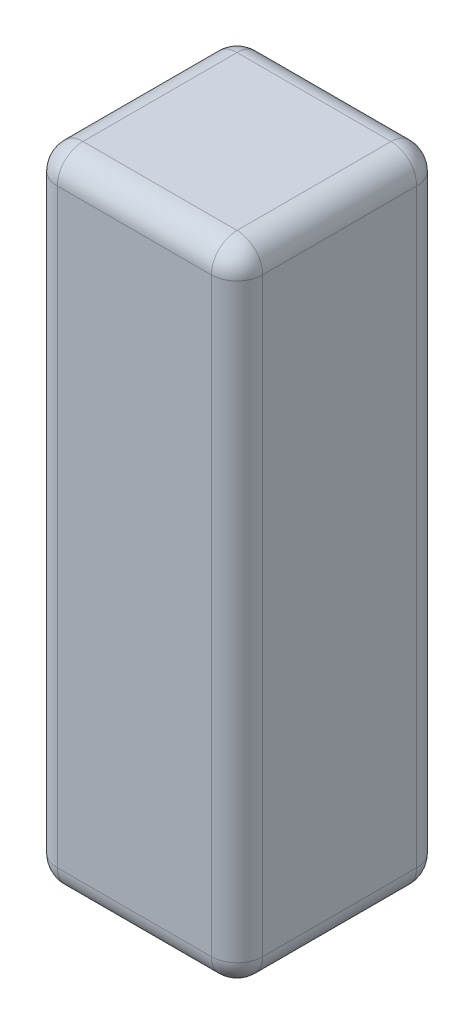
ISO-10303-21;
HEADER;
FILE_DESCRIPTION(('STEP AP214'),'2;1');
FILE_NAME('part.step','',(''),(''),'','','');
FILE_SCHEMA(('AUTOMOTIVE_DESIGN { 1 0 10303 214 1 1 1 1 }'));
ENDSEC;
DATA;
#1=APPLICATION_CONTEXT('core data for automotive mechanical design processes');
#2=APPLICATION_PROTOCOL_DEFINITION('international standard','automotive_design',2000,#1);
#3=PRODUCT_CONTEXT('',#1,'mechanical');
#4=PRODUCT('Part','Part','',(#3));
#5=PRODUCT_RELATED_PRODUCT_CATEGORY('part','',(#4));
#6=PRODUCT_DEFINITION_FORMATION('','',#4);
#7=PRODUCT_DEFINITION_CONTEXT('part definition',#1,'design');
#8=PRODUCT_DEFINITION('design','',#6,#7);
#9=PRODUCT_DEFINITION_SHAPE('','',#8);
#10=(LENGTH_UNIT() NAMED_UNIT(*) SI_UNIT(.MILLI.,.METRE.));
#11=(NAMED_UNIT(*) PLANE_ANGLE_UNIT() SI_UNIT($,.RADIAN.));
#12=(NAMED_UNIT(*) SI_UNIT($,.STERADIAN.) SOLID_ANGLE_UNIT());
#13=UNCERTAINTY_MEASURE_WITH_UNIT(LENGTH_MEASURE(1.E-05),#10,'distance_accuracy_value','');
#14=(GEOMETRIC_REPRESENTATION_CONTEXT(3) GLOBAL_UNCERTAINTY_ASSIGNED_CONTEXT((#13)) GLOBAL_UNIT_ASSIGNED_CONTEXT((#10,
#11,#12)) REPRESENTATION_CONTEXT('',''));
#15=CARTESIAN_POINT('',(0.,0.,0.));
#16=DIRECTION('',(0.,0.,1.));
#17=DIRECTION('',(1.,0.,0.));
#18=AXIS2_PLACEMENT_3D('',#15,#16,#17);
#19=CARTESIAN_POINT('',(52.585871193538,-113.776616403823,-32.));
#20=DIRECTION('',(-1.,0.,0.));
#21=DIRECTION('',(0.,-1.,0.));
#22=AXIS2_PLACEMENT_3D('',#19,#20,#21);
#23=PLANE('',#22);
#24=DIRECTION('',(0.,-1.,0.));
#25=VECTOR('',#24,1.);
#26=CARTESIAN_POINT('',(52.585871193538,-213.776616403823,-28.));
#27=LINE('',#26,#25);
#28=CARTESIAN_POINT('',(52.585871193538,-117.776616403823,-28.));
#29=VERTEX_POINT('',#28);
#30=CARTESIAN_POINT('',(52.585871193538,-209.776616403823,-28.));
#31=VERTEX_POINT('',#30);
#32=EDGE_CURVE('E243',#29,#31,#27,.T.);
#33=ORIENTED_EDGE('',*,*,#32,.T.);
#34=DIRECTION('',(0.,0.,1.));
#35=VECTOR('',#34,1.);
#36=CARTESIAN_POINT('',(52.585871193538,-209.776616403823,-32.));
#37=LINE('',#36,#35);
#38=CARTESIAN_POINT('',(52.585871193538,-209.776616403823,-4.));
#39=VERTEX_POINT('',#38);
#40=EDGE_CURVE('E258',#31,#39,#37,.T.);
#41=ORIENTED_EDGE('',*,*,#40,.T.);
#42=DIRECTION('',(0.,-1.,0.));
#43=VECTOR('',#42,1.);
#44=CARTESIAN_POINT('',(52.585871193538,-113.776616403823,-4.));
#45=LINE('',#44,#43);
#46=CARTESIAN_POINT('',(52.585871193538,-117.776616403823,-4.));
#47=VERTEX_POINT('',#46);
#48=EDGE_CURVE('E251',#39,#47,#45,.F.);
#49=ORIENTED_EDGE('',*,*,#48,.T.);
#50=DIRECTION('',(0.,0.,1.));
#51=VECTOR('',#50,1.);
#52=CARTESIAN_POINT('',(52.585871193538,-117.776616403823,-32.));
#53=LINE('',#52,#51);
#54=EDGE_CURVE('E252',#47,#29,#53,.F.);
#55=ORIENTED_EDGE('',*,*,#54,.T.);
#56=EDGE_LOOP('',(#33,#41,#49,#55));
#57=FACE_BOUND('',#56,.T.);
#58=ADVANCED_FACE('F36',(#57),#23,.T.);
#59=CARTESIAN_POINT('',(52.585871193538,-113.776616403823,-32.));
#60=DIRECTION('',(0.,1.,0.));
#61=DIRECTION('',(0.,0.,1.));
#62=AXIS2_PLACEMENT_3D('',#59,#60,#61);
#63=PLANE('',#62);
#64=DIRECTION('',(-1.,0.,0.));
#65=VECTOR('',#64,1.);
#66=CARTESIAN_POINT('',(52.585871193538,-113.776616403823,-28.));
#67=LINE('',#66,#65);
#68=CARTESIAN_POINT('',(80.585871193538,-113.776616403823,-28.));
#69=VERTEX_POINT('',#68);
#70=CARTESIAN_POINT('',(56.585871193538,-113.776616403823,-28.));
#71=VERTEX_POINT('',#70);
#72=EDGE_CURVE('E226',#69,#71,#67,.T.);
#73=ORIENTED_EDGE('',*,*,#72,.T.);
#74=DIRECTION('',(0.,0.,1.));
#75=VECTOR('',#74,1.);
#76=CARTESIAN_POINT('',(56.585871193538,-113.776616403823,-32.));
#77=LINE('',#76,#75);
#78=CARTESIAN_POINT('',(56.585871193538,-113.776616403823,-4.));
#79=VERTEX_POINT('',#78);
#80=EDGE_CURVE('E11',#71,#79,#77,.T.);
#81=ORIENTED_EDGE('',*,*,#80,.T.);
#82=DIRECTION('',(-1.,0.,0.));
#83=VECTOR('',#82,1.);
#84=CARTESIAN_POINT('',(52.585871193538,-113.776616403823,-4.));
#85=LINE('',#84,#83);
#86=CARTESIAN_POINT('',(80.585871193538,-113.776616403823,-4.));
#87=VERTEX_POINT('',#86);
#88=EDGE_CURVE('E46',#79,#87,#85,.F.);
#89=ORIENTED_EDGE('',*,*,#88,.T.);
#90=DIRECTION('',(0.,0.,1.));
#91=VECTOR('',#90,1.);
#92=CARTESIAN_POINT('',(80.585871193538,-113.776616403823,-32.));
#93=LINE('',#92,#91);
#94=EDGE_CURVE('E222',#87,#69,#93,.F.);
#95=ORIENTED_EDGE('',*,*,#94,.T.);
#96=EDGE_LOOP('',(#73,#81,#89,#95));
#97=FACE_BOUND('',#96,.T.);
#98=ADVANCED_FACE('F224',(#97),#63,.T.);
#99=CARTESIAN_POINT('',(84.585871193538,-113.776616403823,-32.));
#100=DIRECTION('',(1.,0.,0.));
#101=DIRECTION('',(0.,0.,-1.));
#102=AXIS2_PLACEMENT_3D('',#99,#100,#101);
#103=PLANE('',#102);
#104=DIRECTION('',(0.,1.,0.));
#105=VECTOR('',#104,1.);
#106=CARTESIAN_POINT('',(84.585871193538,-113.776616403823,-4.));
#107=LINE('',#106,#105);
#108=CARTESIAN_POINT('',(84.585871193538,-117.776616403823,-4.));
#109=VERTEX_POINT('',#108);
#110=CARTESIAN_POINT('',(84.585871193538,-209.776616403823,-4.));
#111=VERTEX_POINT('',#110);
#112=EDGE_CURVE('E272',#109,#111,#107,.F.);
#113=ORIENTED_EDGE('',*,*,#112,.T.);
#114=DIRECTION('',(0.,0.,1.));
#115=VECTOR('',#114,1.);
#116=CARTESIAN_POINT('',(84.585871193538,-209.776616403823,-32.));
#117=LINE('',#116,#115);
#118=CARTESIAN_POINT('',(84.585871193538,-209.776616403823,-28.));
#119=VERTEX_POINT('',#118);
#120=EDGE_CURVE('E163',#111,#119,#117,.F.);
#121=ORIENTED_EDGE('',*,*,#120,.T.);
#122=DIRECTION('',(0.,1.,0.));
#123=VECTOR('',#122,1.);
#124=CARTESIAN_POINT('',(84.585871193538,-113.776616403823,-28.));
#125=LINE('',#124,#123);
#126=CARTESIAN_POINT('',(84.585871193538,-117.776616403823,-28.));
#127=VERTEX_POINT('',#126);
#128=EDGE_CURVE('E267',#119,#127,#125,.T.);
#129=ORIENTED_EDGE('',*,*,#128,.T.);
#130=DIRECTION('',(0.,0.,1.));
#131=VECTOR('',#130,1.);
#132=CARTESIAN_POINT('',(84.585871193538,-117.776616403823,-32.));
#133=LINE('',#132,#131);
#134=EDGE_CURVE('E269',#127,#109,#133,.T.);
#135=ORIENTED_EDGE('',*,*,#134,.T.);
#136=EDGE_LOOP('',(#113,#121,#129,#135));
#137=FACE_BOUND('',#136,.T.);
#138=ADVANCED_FACE('F367',(#137),#103,.T.);
#139=CARTESIAN_POINT('',(52.585871193538,-213.776616403823,-32.));
#140=DIRECTION('',(0.,-1.,0.));
#141=DIRECTION('',(0.,0.,-1.));
#142=AXIS2_PLACEMENT_3D('',#139,#140,#141);
#143=PLANE('',#142);
#144=DIRECTION('',(0.,0.,1.));
#145=VECTOR('',#144,1.);
#146=CARTESIAN_POINT('',(56.585871193538,-213.776616403823,-32.));
#147=LINE('',#146,#145);
#148=CARTESIAN_POINT('',(56.585871193538,-213.776616403823,-4.));
#149=VERTEX_POINT('',#148);
#150=CARTESIAN_POINT('',(56.585871193538,-213.776616403823,-28.));
#151=VERTEX_POINT('',#150);
#152=EDGE_CURVE('E139',#149,#151,#147,.F.);
#153=ORIENTED_EDGE('',*,*,#152,.T.);
#154=DIRECTION('',(1.,0.,0.));
#155=VECTOR('',#154,1.);
#156=CARTESIAN_POINT('',(84.585871193538,-213.776616403823,-28.));
#157=LINE('',#156,#155);
#158=CARTESIAN_POINT('',(80.585871193538,-213.776616403823,-28.));
#159=VERTEX_POINT('',#158);
#160=EDGE_CURVE('E135',#151,#159,#157,.T.);
#161=ORIENTED_EDGE('',*,*,#160,.T.);
#162=DIRECTION('',(0.,0.,1.));
#163=VECTOR('',#162,1.);
#164=CARTESIAN_POINT('',(80.585871193538,-213.776616403823,-32.));
#165=LINE('',#164,#163);
#166=CARTESIAN_POINT('',(80.585871193538,-213.776616403823,-4.));
#167=VERTEX_POINT('',#166);
#168=EDGE_CURVE('E129',#159,#167,#165,.T.);
#169=ORIENTED_EDGE('',*,*,#168,.T.);
#170=DIRECTION('',(1.,0.,0.));
#171=VECTOR('',#170,1.);
#172=CARTESIAN_POINT('',(52.585871193538,-213.776616403823,-4.));
#173=LINE('',#172,#171);
#174=EDGE_CURVE('E132',#167,#149,#173,.F.);
#175=ORIENTED_EDGE('',*,*,#174,.T.);
#176=EDGE_LOOP('',(#153,#161,#169,#175));
#177=FACE_BOUND('',#176,.T.);
#178=ADVANCED_FACE('F131',(#177),#143,.T.);
#179=CARTESIAN_POINT('',(0.,0.,-32.));
#180=DIRECTION('',(0.,0.,1.));
#181=DIRECTION('',(1.,0.,0.));
#182=AXIS2_PLACEMENT_3D('',#179,#180,#181);
#183=PLANE('',#182);
#184=DIRECTION('',(0.,1.,0.));
#185=VECTOR('',#184,1.);
#186=CARTESIAN_POINT('',(80.585871193538,-213.776616403823,-32.));
#187=LINE('',#186,#185);
#188=CARTESIAN_POINT('',(80.585871193538,-117.776616403823,-32.));
#189=VERTEX_POINT('',#188);
#190=CARTESIAN_POINT('',(80.585871193538,-209.776616403823,-32.));
#191=VERTEX_POINT('',#190);
#192=EDGE_CURVE('E318',#189,#191,#187,.F.);
#193=ORIENTED_EDGE('',*,*,#192,.T.);
#194=DIRECTION('',(1.,0.,0.));
#195=VECTOR('',#194,1.);
#196=CARTESIAN_POINT('',(52.585871193538,-209.776616403823,-32.));
#197=LINE('',#196,#195);
#198=CARTESIAN_POINT('',(56.585871193538,-209.776616403823,-32.));
#199=VERTEX_POINT('',#198);
#200=EDGE_CURVE('E261',#191,#199,#197,.F.);
#201=ORIENTED_EDGE('',*,*,#200,.T.);
#202=DIRECTION('',(0.,-1.,0.));
#203=VECTOR('',#202,1.);
#204=CARTESIAN_POINT('',(56.585871193538,-113.776616403823,-32.));
#205=LINE('',#204,#203);
#206=CARTESIAN_POINT('',(56.585871193538,-117.776616403823,-32.));
#207=VERTEX_POINT('',#206);
#208=EDGE_CURVE('E310',#199,#207,#205,.F.);
#209=ORIENTED_EDGE('',*,*,#208,.T.);
#210=DIRECTION('',(-1.,0.,0.));
#211=VECTOR('',#210,1.);
#212=CARTESIAN_POINT('',(84.585871193538,-117.776616403823,-32.));
#213=LINE('',#212,#211);
#214=EDGE_CURVE('E236',#207,#189,#213,.F.);
#215=ORIENTED_EDGE('',*,*,#214,.T.);
#216=EDGE_LOOP('',(#193,#201,#209,#215));
#217=FACE_BOUND('',#216,.T.);
#218=ADVANCED_FACE('F316',(#217),#183,.F.);
#219=CARTESIAN_POINT('',(0.,0.,0.));
#220=DIRECTION('',(0.,0.,1.));
#221=DIRECTION('',(1.,0.,0.));
#222=AXIS2_PLACEMENT_3D('',#219,#220,#221);
#223=PLANE('',#222);
#224=DIRECTION('',(0.,-1.,0.));
#225=VECTOR('',#224,1.);
#226=CARTESIAN_POINT('',(56.585871193538,0.,0.));
#227=LINE('',#226,#225);
#228=CARTESIAN_POINT('',(56.585871193538,-117.776616403823,0.));
#229=VERTEX_POINT('',#228);
#230=CARTESIAN_POINT('',(56.585871193538,-209.776616403823,0.));
#231=VERTEX_POINT('',#230);
#232=EDGE_CURVE('E282',#229,#231,#227,.T.);
#233=ORIENTED_EDGE('',*,*,#232,.T.);
#234=DIRECTION('',(1.,0.,0.));
#235=VECTOR('',#234,1.);
#236=CARTESIAN_POINT('',(0.,-209.776616403823,0.));
#237=LINE('',#236,#235);
#238=CARTESIAN_POINT('',(80.585871193538,-209.776616403823,0.));
#239=VERTEX_POINT('',#238);
#240=EDGE_CURVE('E285',#231,#239,#237,.T.);
#241=ORIENTED_EDGE('',*,*,#240,.T.);
#242=DIRECTION('',(0.,1.,0.));
#243=VECTOR('',#242,1.);
#244=CARTESIAN_POINT('',(80.585871193538,0.,0.));
#245=LINE('',#244,#243);
#246=CARTESIAN_POINT('',(80.585871193538,-117.776616403823,0.));
#247=VERTEX_POINT('',#246);
#248=EDGE_CURVE('E280',#239,#247,#245,.T.);
#249=ORIENTED_EDGE('',*,*,#248,.T.);
#250=DIRECTION('',(-1.,0.,0.));
#251=VECTOR('',#250,1.);
#252=CARTESIAN_POINT('',(0.,-117.776616403823,0.));
#253=LINE('',#252,#251);
#254=EDGE_CURVE('E277',#247,#229,#253,.T.);
#255=ORIENTED_EDGE('',*,*,#254,.T.);
#256=EDGE_LOOP('',(#233,#241,#249,#255));
#257=FACE_BOUND('',#256,.T.);
#258=ADVANCED_FACE('F338',(#257),#223,.T.);
#259=CARTESIAN_POINT('',(0.,-117.776616403823,-4.));
#260=DIRECTION('',(-1.,0.,0.));
#261=DIRECTION('',(0.,0.,1.));
#262=AXIS2_PLACEMENT_3D('',#259,#260,#261);
#263=CYLINDRICAL_SURFACE('',#262,4.);
#264=CARTESIAN_POINT('',(56.585871193538,-117.776616403823,-4.));
#265=DIRECTION('',(-1.,0.,0.));
#266=DIRECTION('',(0.,0.,1.));
#267=AXIS2_PLACEMENT_3D('',#264,#265,#266);
#268=CIRCLE('',#267,4.);
#269=EDGE_CURVE('E40',#229,#79,#268,.T.);
#270=ORIENTED_EDGE('',*,*,#269,.F.);
#271=ORIENTED_EDGE('',*,*,#254,.F.);
#272=CARTESIAN_POINT('',(80.585871193538,-117.776616403823,-4.));
#273=DIRECTION('',(1.,0.,0.));
#274=DIRECTION('',(0.,0.,-1.));
#275=AXIS2_PLACEMENT_3D('',#272,#273,#274);
#276=CIRCLE('',#275,4.);
#277=EDGE_CURVE('E205',#87,#247,#276,.T.);
#278=ORIENTED_EDGE('',*,*,#277,.F.);
#279=ORIENTED_EDGE('',*,*,#88,.F.);
#280=EDGE_LOOP('',(#270,#271,#278,#279));
#281=FACE_BOUND('',#280,.T.);
#282=ADVANCED_FACE('F38',(#281),#263,.T.);
#283=CARTESIAN_POINT('',(56.585871193538,-117.776616403823,-4.));
#284=DIRECTION('',(0.,0.,1.));
#285=DIRECTION('',(1.,0.,0.));
#286=AXIS2_PLACEMENT_3D('',#283,#284,#285);
#287=SPHERICAL_SURFACE('',#286,4.);
#288=CARTESIAN_POINT('',(56.585871193538,-117.776616403823,-4.));
#289=DIRECTION('',(0.,1.,0.));
#290=DIRECTION('',(0.,0.,1.));
#291=AXIS2_PLACEMENT_3D('',#288,#289,#290);
#292=CIRCLE('',#291,4.);
#293=EDGE_CURVE('E202',#229,#47,#292,.F.);
#294=ORIENTED_EDGE('',*,*,#293,.F.);
#295=ORIENTED_EDGE('',*,*,#269,.T.);
#296=CARTESIAN_POINT('',(56.585871193538,-117.776616403823,-4.));
#297=DIRECTION('',(0.,0.,1.));
#298=DIRECTION('',(1.,0.,0.));
#299=AXIS2_PLACEMENT_3D('',#296,#297,#298);
#300=CIRCLE('',#299,4.);
#301=EDGE_CURVE('E54',#47,#79,#300,.F.);
#302=ORIENTED_EDGE('',*,*,#301,.F.);
#303=EDGE_LOOP('',(#294,#295,#302));
#304=FACE_BOUND('',#303,.T.);
#305=ADVANCED_FACE('F217',(#304),#287,.T.);
#306=CARTESIAN_POINT('',(80.585871193538,-117.776616403823,-4.));
#307=DIRECTION('',(0.,0.,1.));
#308=DIRECTION('',(1.,0.,0.));
#309=AXIS2_PLACEMENT_3D('',#306,#307,#308);
#310=SPHERICAL_SURFACE('',#309,4.);
#311=CARTESIAN_POINT('',(80.585871193538,-117.776616403823,-4.));
#312=DIRECTION('',(0.,0.,1.));
#313=DIRECTION('',(1.,0.,0.));
#314=AXIS2_PLACEMENT_3D('',#311,#312,#313);
#315=CIRCLE('',#314,4.);
#316=EDGE_CURVE('E196',#87,#109,#315,.F.);
#317=ORIENTED_EDGE('',*,*,#316,.F.);
#318=ORIENTED_EDGE('',*,*,#277,.T.);
#319=CARTESIAN_POINT('',(80.585871193538,-117.776616403823,-4.));
#320=DIRECTION('',(0.,1.,0.));
#321=DIRECTION('',(0.,0.,1.));
#322=AXIS2_PLACEMENT_3D('',#319,#320,#321);
#323=CIRCLE('',#322,4.);
#324=EDGE_CURVE('E199',#109,#247,#323,.F.);
#325=ORIENTED_EDGE('',*,*,#324,.F.);
#326=EDGE_LOOP('',(#317,#318,#325));
#327=FACE_BOUND('',#326,.T.);
#328=ADVANCED_FACE('F342',(#327),#310,.T.);
#329=CARTESIAN_POINT('',(56.585871193538,-117.776616403823,-32.));
#330=DIRECTION('',(0.,0.,1.));
#331=DIRECTION('',(1.,0.,0.));
#332=AXIS2_PLACEMENT_3D('',#329,#330,#331);
#333=CYLINDRICAL_SURFACE('',#332,4.);
#334=ORIENTED_EDGE('',*,*,#301,.T.);
#335=ORIENTED_EDGE('',*,*,#80,.F.);
#336=CARTESIAN_POINT('',(56.585871193538,-117.776616403823,-28.));
#337=DIRECTION('',(0.,0.,-1.));
#338=DIRECTION('',(-1.,0.,0.));
#339=AXIS2_PLACEMENT_3D('',#336,#337,#338);
#340=CIRCLE('',#339,4.);
#341=EDGE_CURVE('E190',#29,#71,#340,.T.);
#342=ORIENTED_EDGE('',*,*,#341,.F.);
#343=ORIENTED_EDGE('',*,*,#54,.F.);
#344=EDGE_LOOP('',(#334,#335,#342,#343));
#345=FACE_BOUND('',#344,.T.);
#346=ADVANCED_FACE('F229',(#345),#333,.T.);
#347=CARTESIAN_POINT('',(56.585871193538,0.,-4.));
#348=DIRECTION('',(0.,-1.,0.));
#349=DIRECTION('',(1.,0.,0.));
#350=AXIS2_PLACEMENT_3D('',#347,#348,#349);
#351=CYLINDRICAL_SURFACE('',#350,4.);
#352=ORIENTED_EDGE('',*,*,#293,.T.);
#353=ORIENTED_EDGE('',*,*,#48,.F.);
#354=CARTESIAN_POINT('',(56.585871193538,-209.776616403823,-4.));
#355=DIRECTION('',(0.,-1.,0.));
#356=DIRECTION('',(0.,0.,-1.));
#357=AXIS2_PLACEMENT_3D('',#354,#355,#356);
#358=CIRCLE('',#357,4.);
#359=EDGE_CURVE('E186',#231,#39,#358,.T.);
#360=ORIENTED_EDGE('',*,*,#359,.F.);
#361=ORIENTED_EDGE('',*,*,#232,.F.);
#362=EDGE_LOOP('',(#352,#353,#360,#361));
#363=FACE_BOUND('',#362,.T.);
#364=ADVANCED_FACE('F336',(#363),#351,.T.);
#365=CARTESIAN_POINT('',(0.,-209.776616403823,-4.));
#366=DIRECTION('',(1.,0.,0.));
#367=DIRECTION('',(0.,0.,-1.));
#368=AXIS2_PLACEMENT_3D('',#365,#366,#367);
#369=CYLINDRICAL_SURFACE('',#368,4.);
#370=CARTESIAN_POINT('',(80.585871193538,-209.776616403823,-4.));
#371=DIRECTION('',(1.,0.,0.));
#372=DIRECTION('',(0.,0.,-1.));
#373=AXIS2_PLACEMENT_3D('',#370,#371,#372);
#374=CIRCLE('',#373,4.);
#375=EDGE_CURVE('E146',#239,#167,#374,.T.);
#376=ORIENTED_EDGE('',*,*,#375,.F.);
#377=ORIENTED_EDGE('',*,*,#240,.F.);
#378=CARTESIAN_POINT('',(56.585871193538,-209.776616403823,-4.));
#379=DIRECTION('',(-1.,0.,0.));
#380=DIRECTION('',(0.,0.,1.));
#381=AXIS2_PLACEMENT_3D('',#378,#379,#380);
#382=CIRCLE('',#381,4.);
#383=EDGE_CURVE('E149',#149,#231,#382,.T.);
#384=ORIENTED_EDGE('',*,*,#383,.F.);
#385=ORIENTED_EDGE('',*,*,#174,.F.);
#386=EDGE_LOOP('',(#376,#377,#384,#385));
#387=FACE_BOUND('',#386,.T.);
#388=ADVANCED_FACE('F144',(#387),#369,.T.);
#389=CARTESIAN_POINT('',(80.585871193538,0.,-4.));
#390=DIRECTION('',(0.,1.,0.));
#391=DIRECTION('',(0.,0.,1.));
#392=AXIS2_PLACEMENT_3D('',#389,#390,#391);
#393=CYLINDRICAL_SURFACE('',#392,4.);
#394=ORIENTED_EDGE('',*,*,#324,.T.);
#395=ORIENTED_EDGE('',*,*,#248,.F.);
#396=CARTESIAN_POINT('',(80.585871193538,-209.776616403823,-4.));
#397=DIRECTION('',(0.,-1.,0.));
#398=DIRECTION('',(0.,0.,-1.));
#399=AXIS2_PLACEMENT_3D('',#396,#397,#398);
#400=CIRCLE('',#399,4.);
#401=EDGE_CURVE('E159',#111,#239,#400,.T.);
#402=ORIENTED_EDGE('',*,*,#401,.F.);
#403=ORIENTED_EDGE('',*,*,#112,.F.);
#404=EDGE_LOOP('',(#394,#395,#402,#403));
#405=FACE_BOUND('',#404,.T.);
#406=ADVANCED_FACE('F340',(#405),#393,.T.);
#407=CARTESIAN_POINT('',(80.585871193538,-117.776616403823,-32.));
#408=DIRECTION('',(0.,0.,1.));
#409=DIRECTION('',(1.,0.,0.));
#410=AXIS2_PLACEMENT_3D('',#407,#408,#409);
#411=CYLINDRICAL_SURFACE('',#410,4.);
#412=ORIENTED_EDGE('',*,*,#316,.T.);
#413=ORIENTED_EDGE('',*,*,#134,.F.);
#414=CARTESIAN_POINT('',(80.585871193538,-117.776616403823,-28.));
#415=DIRECTION('',(0.,0.,-1.));
#416=DIRECTION('',(-1.,0.,0.));
#417=AXIS2_PLACEMENT_3D('',#414,#415,#416);
#418=CIRCLE('',#417,4.);
#419=EDGE_CURVE('E181',#69,#127,#418,.T.);
#420=ORIENTED_EDGE('',*,*,#419,.F.);
#421=ORIENTED_EDGE('',*,*,#94,.F.);
#422=EDGE_LOOP('',(#412,#413,#420,#421));
#423=FACE_BOUND('',#422,.T.);
#424=ADVANCED_FACE('F346',(#423),#411,.T.);
#425=CARTESIAN_POINT('',(52.585871193538,-117.776616403823,-28.));
#426=DIRECTION('',(1.,0.,0.));
#427=DIRECTION('',(0.,0.,-1.));
#428=AXIS2_PLACEMENT_3D('',#425,#426,#427);
#429=CYLINDRICAL_SURFACE('',#428,4.);
#430=CARTESIAN_POINT('',(56.585871193538,-117.776616403823,-28.));
#431=DIRECTION('',(-1.,0.,0.));
#432=DIRECTION('',(0.,0.,1.));
#433=AXIS2_PLACEMENT_3D('',#430,#431,#432);
#434=CIRCLE('',#433,4.);
#435=EDGE_CURVE('E193',#71,#207,#434,.T.);
#436=ORIENTED_EDGE('',*,*,#435,.F.);
#437=ORIENTED_EDGE('',*,*,#72,.F.);
#438=CARTESIAN_POINT('',(80.585871193538,-117.776616403823,-28.));
#439=DIRECTION('',(1.,0.,0.));
#440=DIRECTION('',(0.,0.,-1.));
#441=AXIS2_PLACEMENT_3D('',#438,#439,#440);
#442=CIRCLE('',#441,4.);
#443=EDGE_CURVE('E177',#189,#69,#442,.T.);
#444=ORIENTED_EDGE('',*,*,#443,.F.);
#445=ORIENTED_EDGE('',*,*,#214,.F.);
#446=EDGE_LOOP('',(#436,#437,#444,#445));
#447=FACE_BOUND('',#446,.T.);
#448=ADVANCED_FACE('F233',(#447),#429,.T.);
#449=CARTESIAN_POINT('',(56.585871193538,-117.776616403823,-28.));
#450=DIRECTION('',(0.,0.,1.));
#451=DIRECTION('',(1.,0.,0.));
#452=AXIS2_PLACEMENT_3D('',#449,#450,#451);
#453=SPHERICAL_SURFACE('',#452,4.);
#454=ORIENTED_EDGE('',*,*,#341,.T.);
#455=ORIENTED_EDGE('',*,*,#435,.T.);
#456=CARTESIAN_POINT('',(56.585871193538,-117.776616403823,-28.));
#457=DIRECTION('',(0.,1.,0.));
#458=DIRECTION('',(0.,0.,1.));
#459=AXIS2_PLACEMENT_3D('',#456,#457,#458);
#460=CIRCLE('',#459,4.);
#461=EDGE_CURVE('E168',#29,#207,#460,.F.);
#462=ORIENTED_EDGE('',*,*,#461,.F.);
#463=EDGE_LOOP('',(#454,#455,#462));
#464=FACE_BOUND('',#463,.T.);
#465=ADVANCED_FACE('F238',(#464),#453,.T.);
#466=CARTESIAN_POINT('',(56.585871193538,-209.776616403823,-4.));
#467=DIRECTION('',(0.,0.,1.));
#468=DIRECTION('',(1.,0.,0.));
#469=AXIS2_PLACEMENT_3D('',#466,#467,#468);
#470=SPHERICAL_SURFACE('',#469,4.);
#471=ORIENTED_EDGE('',*,*,#383,.T.);
#472=ORIENTED_EDGE('',*,*,#359,.T.);
#473=CARTESIAN_POINT('',(56.585871193538,-209.776616403823,-4.));
#474=DIRECTION('',(0.,0.,1.));
#475=DIRECTION('',(1.,0.,0.));
#476=AXIS2_PLACEMENT_3D('',#473,#474,#475);
#477=CIRCLE('',#476,4.);
#478=EDGE_CURVE('E164',#149,#39,#477,.F.);
#479=ORIENTED_EDGE('',*,*,#478,.F.);
#480=EDGE_LOOP('',(#471,#472,#479));
#481=FACE_BOUND('',#480,.T.);
#482=ADVANCED_FACE('F448',(#481),#470,.T.);
#483=CARTESIAN_POINT('',(80.585871193538,-209.776616403823,-4.));
#484=DIRECTION('',(0.,0.,1.));
#485=DIRECTION('',(1.,0.,0.));
#486=AXIS2_PLACEMENT_3D('',#483,#484,#485);
#487=SPHERICAL_SURFACE('',#486,4.);
#488=ORIENTED_EDGE('',*,*,#401,.T.);
#489=ORIENTED_EDGE('',*,*,#375,.T.);
#490=CARTESIAN_POINT('',(80.585871193538,-209.776616403823,-4.));
#491=DIRECTION('',(0.,0.,1.));
#492=DIRECTION('',(1.,0.,0.));
#493=AXIS2_PLACEMENT_3D('',#490,#491,#492);
#494=CIRCLE('',#493,4.);
#495=EDGE_CURVE('E156',#111,#167,#494,.F.);
#496=ORIENTED_EDGE('',*,*,#495,.F.);
#497=EDGE_LOOP('',(#488,#489,#496));
#498=FACE_BOUND('',#497,.T.);
#499=ADVANCED_FACE('F155',(#498),#487,.T.);
#500=CARTESIAN_POINT('',(80.585871193538,-117.776616403823,-28.));
#501=DIRECTION('',(0.,0.,1.));
#502=DIRECTION('',(1.,0.,0.));
#503=AXIS2_PLACEMENT_3D('',#500,#501,#502);
#504=SPHERICAL_SURFACE('',#503,4.);
#505=ORIENTED_EDGE('',*,*,#443,.T.);
#506=ORIENTED_EDGE('',*,*,#419,.T.);
#507=CARTESIAN_POINT('',(80.585871193538,-117.776616403823,-28.));
#508=DIRECTION('',(0.,1.,0.));
#509=DIRECTION('',(0.,0.,1.));
#510=AXIS2_PLACEMENT_3D('',#507,#508,#509);
#511=CIRCLE('',#510,4.);
#512=EDGE_CURVE('E165',#189,#127,#511,.F.);
#513=ORIENTED_EDGE('',*,*,#512,.F.);
#514=EDGE_LOOP('',(#505,#506,#513));
#515=FACE_BOUND('',#514,.T.);
#516=ADVANCED_FACE('F349',(#515),#504,.T.);
#517=CARTESIAN_POINT('',(56.585871193538,-113.776616403823,-28.));
#518=DIRECTION('',(0.,1.,0.));
#519=DIRECTION('',(-1.,0.,0.));
#520=AXIS2_PLACEMENT_3D('',#517,#518,#519);
#521=CYLINDRICAL_SURFACE('',#520,4.);
#522=ORIENTED_EDGE('',*,*,#461,.T.);
#523=ORIENTED_EDGE('',*,*,#208,.F.);
#524=CARTESIAN_POINT('',(56.585871193538,-209.776616403823,-28.));
#525=DIRECTION('',(0.,-1.,0.));
#526=DIRECTION('',(0.,0.,-1.));
#527=AXIS2_PLACEMENT_3D('',#524,#525,#526);
#528=CIRCLE('',#527,4.);
#529=EDGE_CURVE('E171',#31,#199,#528,.T.);
#530=ORIENTED_EDGE('',*,*,#529,.F.);
#531=ORIENTED_EDGE('',*,*,#32,.F.);
#532=EDGE_LOOP('',(#522,#523,#530,#531));
#533=FACE_BOUND('',#532,.T.);
#534=ADVANCED_FACE('F244',(#533),#521,.T.);
#535=CARTESIAN_POINT('',(56.585871193538,-209.776616403823,-32.));
#536=DIRECTION('',(0.,0.,1.));
#537=DIRECTION('',(1.,0.,0.));
#538=AXIS2_PLACEMENT_3D('',#535,#536,#537);
#539=CYLINDRICAL_SURFACE('',#538,4.);
#540=ORIENTED_EDGE('',*,*,#478,.T.);
#541=ORIENTED_EDGE('',*,*,#40,.F.);
#542=CARTESIAN_POINT('',(56.585871193538,-209.776616403823,-28.));
#543=DIRECTION('',(0.,0.,-1.));
#544=DIRECTION('',(-1.,0.,0.));
#545=AXIS2_PLACEMENT_3D('',#542,#543,#544);
#546=CIRCLE('',#545,4.);
#547=EDGE_CURVE('E302',#151,#31,#546,.T.);
#548=ORIENTED_EDGE('',*,*,#547,.F.);
#549=ORIENTED_EDGE('',*,*,#152,.F.);
#550=EDGE_LOOP('',(#540,#541,#548,#549));
#551=FACE_BOUND('',#550,.T.);
#552=ADVANCED_FACE('F332',(#551),#539,.T.);
#553=CARTESIAN_POINT('',(80.585871193538,-209.776616403823,-32.));
#554=DIRECTION('',(0.,0.,1.));
#555=DIRECTION('',(1.,0.,0.));
#556=AXIS2_PLACEMENT_3D('',#553,#554,#555);
#557=CYLINDRICAL_SURFACE('',#556,4.);
#558=ORIENTED_EDGE('',*,*,#495,.T.);
#559=ORIENTED_EDGE('',*,*,#168,.F.);
#560=CARTESIAN_POINT('',(80.585871193538,-209.776616403823,-28.));
#561=DIRECTION('',(0.,0.,-1.));
#562=DIRECTION('',(-1.,0.,0.));
#563=AXIS2_PLACEMENT_3D('',#560,#561,#562);
#564=CIRCLE('',#563,4.);
#565=EDGE_CURVE('E298',#119,#159,#564,.T.);
#566=ORIENTED_EDGE('',*,*,#565,.F.);
#567=ORIENTED_EDGE('',*,*,#120,.F.);
#568=EDGE_LOOP('',(#558,#559,#566,#567));
#569=FACE_BOUND('',#568,.T.);
#570=ADVANCED_FACE('F161',(#569),#557,.T.);
#571=CARTESIAN_POINT('',(80.585871193538,-113.776616403823,-28.));
#572=DIRECTION('',(0.,-1.,0.));
#573=DIRECTION('',(0.,0.,-1.));
#574=AXIS2_PLACEMENT_3D('',#571,#572,#573);
#575=CYLINDRICAL_SURFACE('',#574,4.);
#576=ORIENTED_EDGE('',*,*,#512,.T.);
#577=ORIENTED_EDGE('',*,*,#128,.F.);
#578=CARTESIAN_POINT('',(80.585871193538,-209.776616403823,-28.));
#579=DIRECTION('',(0.,-1.,0.));
#580=DIRECTION('',(0.,0.,-1.));
#581=AXIS2_PLACEMENT_3D('',#578,#579,#580);
#582=CIRCLE('',#581,4.);
#583=EDGE_CURVE('E296',#191,#119,#582,.T.);
#584=ORIENTED_EDGE('',*,*,#583,.F.);
#585=ORIENTED_EDGE('',*,*,#192,.F.);
#586=EDGE_LOOP('',(#576,#577,#584,#585));
#587=FACE_BOUND('',#586,.T.);
#588=ADVANCED_FACE('F352',(#587),#575,.T.);
#589=CARTESIAN_POINT('',(56.585871193538,-209.776616403823,-28.));
#590=DIRECTION('',(0.,0.,1.));
#591=DIRECTION('',(1.,0.,0.));
#592=AXIS2_PLACEMENT_3D('',#589,#590,#591);
#593=SPHERICAL_SURFACE('',#592,4.);
#594=ORIENTED_EDGE('',*,*,#547,.T.);
#595=ORIENTED_EDGE('',*,*,#529,.T.);
#596=CARTESIAN_POINT('',(56.585871193538,-209.776616403823,-28.));
#597=DIRECTION('',(-1.,0.,0.));
#598=DIRECTION('',(0.,0.,1.));
#599=AXIS2_PLACEMENT_3D('',#596,#597,#598);
#600=CIRCLE('',#599,4.);
#601=EDGE_CURVE('E294',#151,#199,#600,.F.);
#602=ORIENTED_EDGE('',*,*,#601,.F.);
#603=EDGE_LOOP('',(#594,#595,#602));
#604=FACE_BOUND('',#603,.T.);
#605=ADVANCED_FACE('F308',(#604),#593,.T.);
#606=CARTESIAN_POINT('',(80.585871193538,-209.776616403823,-28.));
#607=DIRECTION('',(0.,0.,1.));
#608=DIRECTION('',(1.,0.,0.));
#609=AXIS2_PLACEMENT_3D('',#606,#607,#608);
#610=SPHERICAL_SURFACE('',#609,4.);
#611=ORIENTED_EDGE('',*,*,#583,.T.);
#612=ORIENTED_EDGE('',*,*,#565,.T.);
#613=CARTESIAN_POINT('',(80.585871193538,-209.776616403823,-28.));
#614=DIRECTION('',(1.,0.,0.));
#615=DIRECTION('',(0.,0.,-1.));
#616=AXIS2_PLACEMENT_3D('',#613,#614,#615);
#617=CIRCLE('',#616,4.);
#618=EDGE_CURVE('E292',#191,#159,#617,.F.);
#619=ORIENTED_EDGE('',*,*,#618,.F.);
#620=EDGE_LOOP('',(#611,#612,#619));
#621=FACE_BOUND('',#620,.T.);
#622=ADVANCED_FACE('F354',(#621),#610,.T.);
#623=CARTESIAN_POINT('',(52.585871193538,-209.776616403823,-28.));
#624=DIRECTION('',(-1.,0.,0.));
#625=DIRECTION('',(0.,0.,1.));
#626=AXIS2_PLACEMENT_3D('',#623,#624,#625);
#627=CYLINDRICAL_SURFACE('',#626,4.);
#628=ORIENTED_EDGE('',*,*,#601,.T.);
#629=ORIENTED_EDGE('',*,*,#200,.F.);
#630=ORIENTED_EDGE('',*,*,#618,.T.);
#631=ORIENTED_EDGE('',*,*,#160,.F.);
#632=EDGE_LOOP('',(#628,#629,#630,#631));
#633=FACE_BOUND('',#632,.T.);
#634=ADVANCED_FACE('F355',(#633),#627,.T.);
#635=CLOSED_SHELL('',(#58,#98,#138,#178,#218,#258,#282,#305,#328,#346,#364,#388,#406,#424,#448,
#465,#482,#499,#516,#534,#552,#570,#588,#605,#622,#634));
#636=MANIFOLD_SOLID_BREP('B2',#635);
#637=ADVANCED_BREP_SHAPE_REPRESENTATION('',(#18,#636),#14);
#638=SHAPE_DEFINITION_REPRESENTATION(#9,#637);
ENDSEC;
END-ISO-10303-21;
